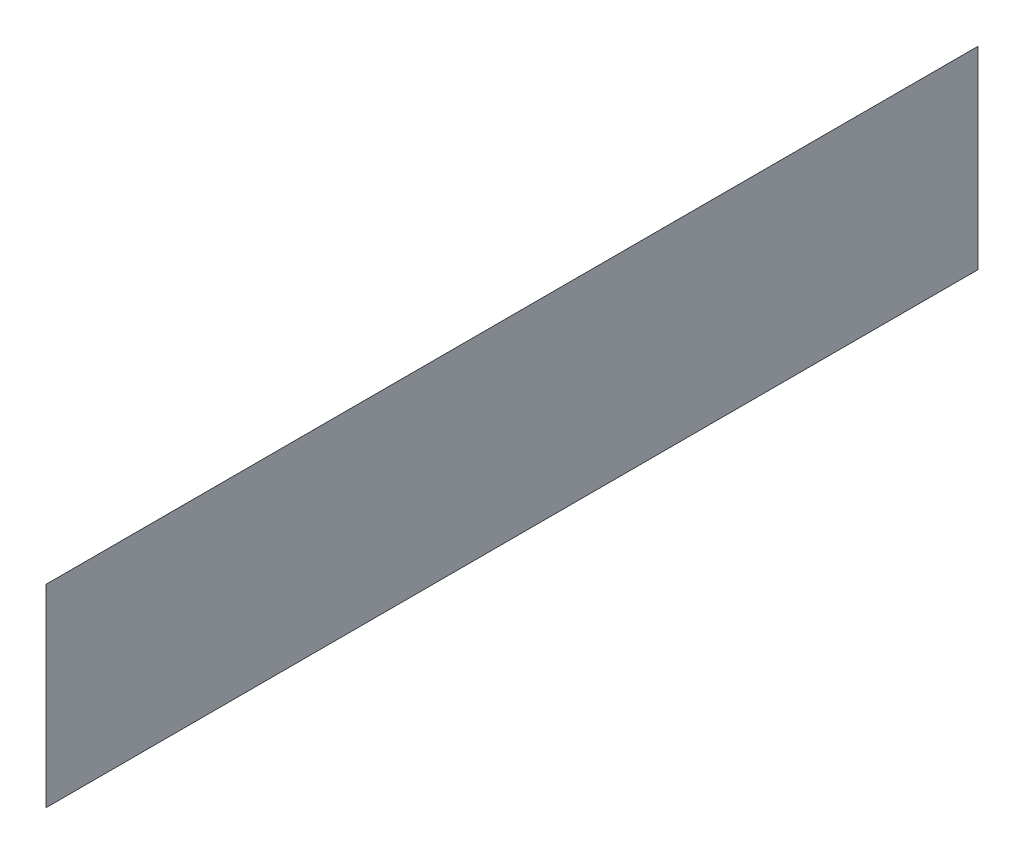
ISO-10303-21;
HEADER;
FILE_DESCRIPTION(('STEP AP214'),'2;1');
FILE_NAME('part.step','',(''),(''),'','','');
FILE_SCHEMA(('AUTOMOTIVE_DESIGN { 1 0 10303 214 1 1 1 1 }'));
ENDSEC;
DATA;
#1=APPLICATION_CONTEXT('core data for automotive mechanical design processes');
#2=APPLICATION_PROTOCOL_DEFINITION('international standard','automotive_design',2000,#1);
#3=PRODUCT_CONTEXT('',#1,'mechanical');
#4=PRODUCT('Part','Part','',(#3));
#5=PRODUCT_RELATED_PRODUCT_CATEGORY('part','',(#4));
#6=PRODUCT_DEFINITION_FORMATION('','',#4);
#7=PRODUCT_DEFINITION_CONTEXT('part definition',#1,'design');
#8=PRODUCT_DEFINITION('design','',#6,#7);
#9=PRODUCT_DEFINITION_SHAPE('','',#8);
#10=(LENGTH_UNIT() NAMED_UNIT(*) SI_UNIT(.MILLI.,.METRE.));
#11=(NAMED_UNIT(*) PLANE_ANGLE_UNIT() SI_UNIT($,.RADIAN.));
#12=(NAMED_UNIT(*) SI_UNIT($,.STERADIAN.) SOLID_ANGLE_UNIT());
#13=UNCERTAINTY_MEASURE_WITH_UNIT(LENGTH_MEASURE(1.E-05),#10,'distance_accuracy_value','');
#14=(GEOMETRIC_REPRESENTATION_CONTEXT(3) GLOBAL_UNCERTAINTY_ASSIGNED_CONTEXT((#13)) GLOBAL_UNIT_ASSIGNED_CONTEXT((#10,
#11,#12)) REPRESENTATION_CONTEXT('',''));
#15=CARTESIAN_POINT('',(0.,0.,0.));
#16=DIRECTION('',(0.,0.,1.));
#17=DIRECTION('',(1.,0.,0.));
#18=AXIS2_PLACEMENT_3D('',#15,#16,#17);
#19=CARTESIAN_POINT('',(0.,32.9,0.));
#20=DIRECTION('',(-1.,0.,0.));
#21=DIRECTION('',(0.,0.,1.));
#22=AXIS2_PLACEMENT_3D('',#19,#20,#21);
#23=PLANE('',#22);
#24=DIRECTION('',(0.,-1.,0.));
#25=VECTOR('',#24,1.);
#26=CARTESIAN_POINT('',(0.,32.9,0.));
#27=LINE('',#26,#25);
#28=CARTESIAN_POINT('',(0.,32.9,0.));
#29=VERTEX_POINT('',#28);
#30=CARTESIAN_POINT('',(0.,-17.9,0.));
#31=VERTEX_POINT('',#30);
#32=EDGE_CURVE('E44',#29,#31,#27,.T.);
#33=ORIENTED_EDGE('',*,*,#32,.T.);
#34=DIRECTION('',(0.,0.,1.));
#35=VECTOR('',#34,1.);
#36=CARTESIAN_POINT('',(0.,-17.9,-244.7));
#37=LINE('',#36,#35);
#38=CARTESIAN_POINT('',(0.,-17.9,-244.7));
#39=VERTEX_POINT('',#38);
#40=EDGE_CURVE('E81',#39,#31,#37,.T.);
#41=ORIENTED_EDGE('',*,*,#40,.F.);
#42=DIRECTION('',(0.,-1.,0.));
#43=VECTOR('',#42,1.);
#44=CARTESIAN_POINT('',(0.,32.9,-244.7));
#45=LINE('',#44,#43);
#46=CARTESIAN_POINT('',(0.,32.9,-244.7));
#47=VERTEX_POINT('',#46);
#48=EDGE_CURVE('E11',#47,#39,#45,.T.);
#49=ORIENTED_EDGE('',*,*,#48,.F.);
#50=DIRECTION('',(0.,0.,-1.));
#51=VECTOR('',#50,1.);
#52=CARTESIAN_POINT('',(0.,32.9,0.));
#53=LINE('',#52,#51);
#54=EDGE_CURVE('E59',#29,#47,#53,.T.);
#55=ORIENTED_EDGE('',*,*,#54,.F.);
#56=EDGE_LOOP('',(#33,#41,#49,#55));
#57=FACE_BOUND('',#56,.T.);
#58=ADVANCED_FACE('F37',(#57),#23,.F.);
#59=CARTESIAN_POINT('',(0.,32.9,-244.7));
#60=DIRECTION('',(0.707106781186552,0.,0.707106781186544));
#61=DIRECTION('',(0.707106781186544,0.,-0.707106781186551));
#62=AXIS2_PLACEMENT_3D('',#59,#60,#61);
#63=PLANE('',#62);
#64=ORIENTED_EDGE('',*,*,#48,.T.);
#65=DIRECTION('',(0.707106781186544,0.,-0.707106781186552));
#66=VECTOR('',#65,1.);
#67=CARTESIAN_POINT('',(-32.9016785286102,-17.9,-211.798321471389));
#68=LINE('',#67,#66);
#69=CARTESIAN_POINT('',(-32.9016785286102,-17.9,-211.798321471389));
#70=VERTEX_POINT('',#69);
#71=EDGE_CURVE('E94',#70,#39,#68,.T.);
#72=ORIENTED_EDGE('',*,*,#71,.F.);
#73=DIRECTION('',(0.,1.,0.));
#74=VECTOR('',#73,1.);
#75=CARTESIAN_POINT('',(-32.9016785286102,-17.9,-211.798321471389));
#76=LINE('',#75,#74);
#77=CARTESIAN_POINT('',(-32.9016785286102,0.,-211.798321471389));
#78=VERTEX_POINT('',#77);
#79=EDGE_CURVE('E51',#70,#78,#76,.T.);
#80=ORIENTED_EDGE('',*,*,#79,.T.);
#81=DIRECTION('',(0.577360087320367,0.577330632427233,-0.577360087320373));
#82=VECTOR('',#81,1.);
#83=CARTESIAN_POINT('',(0.,32.9,-244.7));
#84=LINE('',#83,#82);
#85=EDGE_CURVE('E103',#78,#47,#84,.T.);
#86=ORIENTED_EDGE('',*,*,#85,.T.);
#87=EDGE_LOOP('',(#64,#72,#80,#86));
#88=FACE_BOUND('',#87,.T.);
#89=ADVANCED_FACE('F111',(#88),#63,.F.);
#90=CARTESIAN_POINT('',(0.,32.9,0.));
#91=DIRECTION('',(0.707106781186544,0.,-0.707106781186551));
#92=DIRECTION('',(-0.707106781186551,0.,-0.707106781186544));
#93=AXIS2_PLACEMENT_3D('',#90,#91,#92);
#94=PLANE('',#93);
#95=ORIENTED_EDGE('',*,*,#32,.F.);
#96=DIRECTION('',(-0.577360087320371,-0.577330632427237,-0.577360087320365));
#97=VECTOR('',#96,1.);
#98=CARTESIAN_POINT('',(0.,32.9,0.));
#99=LINE('',#98,#97);
#100=CARTESIAN_POINT('',(-32.9016785286102,0.,-32.9016785286099));
#101=VERTEX_POINT('',#100);
#102=EDGE_CURVE('E101',#29,#101,#99,.T.);
#103=ORIENTED_EDGE('',*,*,#102,.T.);
#104=DIRECTION('',(0.,1.,0.));
#105=VECTOR('',#104,1.);
#106=CARTESIAN_POINT('',(-32.9016785286102,-17.9,-32.9016785286099));
#107=LINE('',#106,#105);
#108=CARTESIAN_POINT('',(-32.9016785286102,-17.9,-32.9016785286099));
#109=VERTEX_POINT('',#108);
#110=EDGE_CURVE('E87',#109,#101,#107,.T.);
#111=ORIENTED_EDGE('',*,*,#110,.F.);
#112=DIRECTION('',(-0.707106781186551,0.,-0.707106781186543));
#113=VECTOR('',#112,1.);
#114=CARTESIAN_POINT('',(0.,-17.9,0.));
#115=LINE('',#114,#113);
#116=EDGE_CURVE('E85',#31,#109,#115,.T.);
#117=ORIENTED_EDGE('',*,*,#116,.F.);
#118=EDGE_LOOP('',(#95,#103,#111,#117));
#119=FACE_BOUND('',#118,.T.);
#120=ADVANCED_FACE('F86',(#119),#94,.F.);
#121=CARTESIAN_POINT('',(0.,32.9,-275.9));
#122=DIRECTION('',(0.707088743438467,-0.707124818474511,0.));
#123=DIRECTION('',(0.707124818474511,0.707088743438467,0.));
#124=AXIS2_PLACEMENT_3D('',#121,#122,#123);
#125=PLANE('',#124);
#126=DIRECTION('',(0.,0.,1.));
#127=VECTOR('',#126,1.);
#128=CARTESIAN_POINT('',(-32.9016785286102,0.,-32.9016785286099));
#129=LINE('',#128,#127);
#130=EDGE_CURVE('E105',#78,#101,#129,.T.);
#131=ORIENTED_EDGE('',*,*,#130,.T.);
#132=ORIENTED_EDGE('',*,*,#102,.F.);
#133=ORIENTED_EDGE('',*,*,#54,.T.);
#134=ORIENTED_EDGE('',*,*,#85,.F.);
#135=EDGE_LOOP('',(#131,#132,#133,#134));
#136=FACE_BOUND('',#135,.T.);
#137=ADVANCED_FACE('F108',(#136),#125,.F.);
#138=CARTESIAN_POINT('',(-32.9016785286102,-17.9,-32.9016785286099));
#139=DIRECTION('',(1.,0.,0.));
#140=DIRECTION('',(0.,0.,-1.));
#141=AXIS2_PLACEMENT_3D('',#138,#139,#140);
#142=PLANE('',#141);
#143=ORIENTED_EDGE('',*,*,#130,.F.);
#144=ORIENTED_EDGE('',*,*,#79,.F.);
#145=DIRECTION('',(0.,0.,-1.));
#146=VECTOR('',#145,1.);
#147=CARTESIAN_POINT('',(-32.9016785286102,-17.9,-32.9016785286099));
#148=LINE('',#147,#146);
#149=EDGE_CURVE('E90',#109,#70,#148,.T.);
#150=ORIENTED_EDGE('',*,*,#149,.F.);
#151=ORIENTED_EDGE('',*,*,#110,.T.);
#152=EDGE_LOOP('',(#143,#144,#150,#151));
#153=FACE_BOUND('',#152,.T.);
#154=ADVANCED_FACE('F110',(#153),#142,.F.);
#155=CARTESIAN_POINT('',(0.,-17.9,0.));
#156=DIRECTION('',(0.,-1.,0.));
#157=DIRECTION('',(0.,0.,-1.));
#158=AXIS2_PLACEMENT_3D('',#155,#156,#157);
#159=PLANE('',#158);
#160=ORIENTED_EDGE('',*,*,#40,.T.);
#161=ORIENTED_EDGE('',*,*,#116,.T.);
#162=ORIENTED_EDGE('',*,*,#149,.T.);
#163=ORIENTED_EDGE('',*,*,#71,.T.);
#164=EDGE_LOOP('',(#160,#161,#162,#163));
#165=FACE_BOUND('',#164,.T.);
#166=ADVANCED_FACE('F93',(#165),#159,.T.);
#167=CLOSED_SHELL('',(#58,#89,#120,#137,#154,#166));
#168=MANIFOLD_SOLID_BREP('B2',#167);
#169=ADVANCED_BREP_SHAPE_REPRESENTATION('',(#18,#168),#14);
#170=SHAPE_DEFINITION_REPRESENTATION(#9,#169);
ENDSEC;
END-ISO-10303-21;
